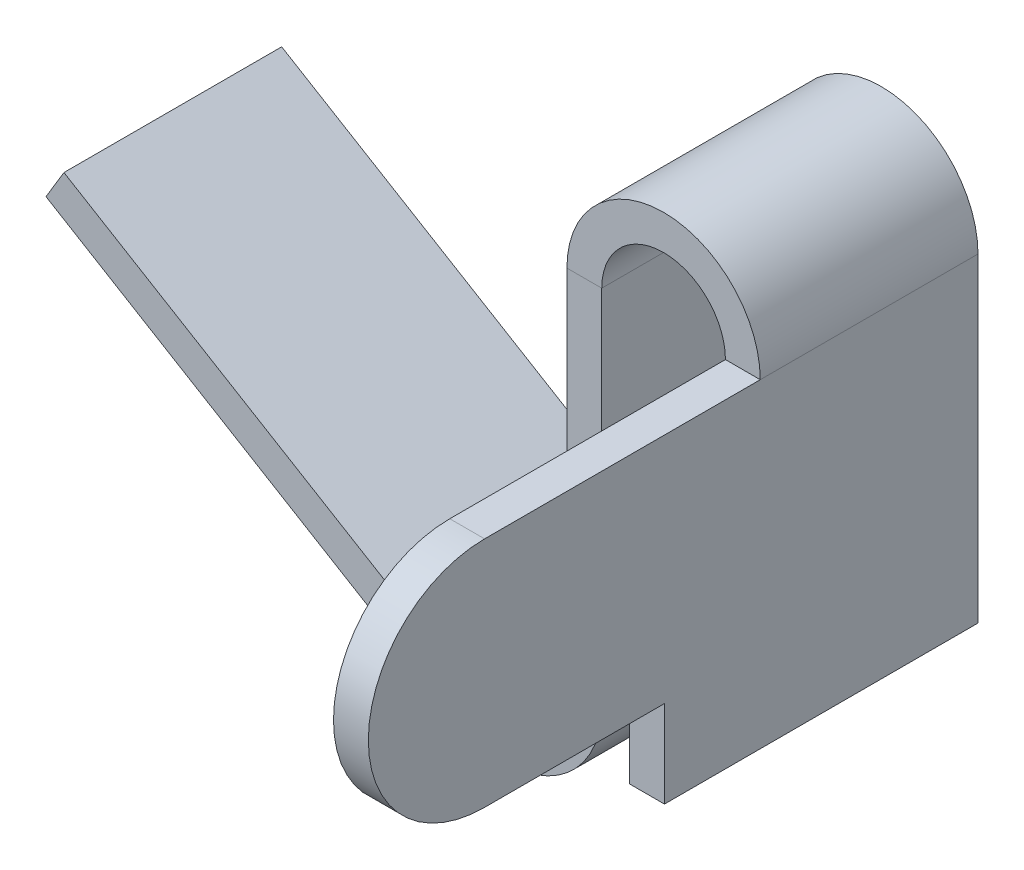
ISO-10303-21;
HEADER;
FILE_DESCRIPTION(('STEP AP214'),'2;1');
FILE_NAME('part.step','',(''),(''),'','','');
FILE_SCHEMA(('AUTOMOTIVE_DESIGN { 1 0 10303 214 1 1 1 1 }'));
ENDSEC;
DATA;
#1=APPLICATION_CONTEXT('core data for automotive mechanical design processes');
#2=APPLICATION_PROTOCOL_DEFINITION('international standard','automotive_design',2000,#1);
#3=PRODUCT_CONTEXT('',#1,'mechanical');
#4=PRODUCT('Part','Part','',(#3));
#5=PRODUCT_RELATED_PRODUCT_CATEGORY('part','',(#4));
#6=PRODUCT_DEFINITION_FORMATION('','',#4);
#7=PRODUCT_DEFINITION_CONTEXT('part definition',#1,'design');
#8=PRODUCT_DEFINITION('design','',#6,#7);
#9=PRODUCT_DEFINITION_SHAPE('','',#8);
#10=(LENGTH_UNIT() NAMED_UNIT(*) SI_UNIT(.MILLI.,.METRE.));
#11=(NAMED_UNIT(*) PLANE_ANGLE_UNIT() SI_UNIT($,.RADIAN.));
#12=(NAMED_UNIT(*) SI_UNIT($,.STERADIAN.) SOLID_ANGLE_UNIT());
#13=UNCERTAINTY_MEASURE_WITH_UNIT(LENGTH_MEASURE(1.E-05),#10,'distance_accuracy_value','');
#14=(GEOMETRIC_REPRESENTATION_CONTEXT(3) GLOBAL_UNCERTAINTY_ASSIGNED_CONTEXT((#13)) GLOBAL_UNIT_ASSIGNED_CONTEXT((#10,
#11,#12)) REPRESENTATION_CONTEXT('',''));
#15=CARTESIAN_POINT('',(0.,0.,0.));
#16=DIRECTION('',(0.,0.,1.));
#17=DIRECTION('',(1.,0.,0.));
#18=AXIS2_PLACEMENT_3D('',#15,#16,#17);
#19=CARTESIAN_POINT('',(1.11,0.5,5.665));
#20=DIRECTION('',(-1.,0.,0.));
#21=DIRECTION('',(0.,-1.,0.));
#22=AXIS2_PLACEMENT_3D('',#19,#20,#21);
#23=CYLINDRICAL_SURFACE('',#22,1.335);
#24=DIRECTION('',(1.,0.,0.));
#25=VECTOR('',#24,1.);
#26=CARTESIAN_POINT('',(1.11,-0.835,5.665));
#27=LINE('',#26,#25);
#28=CARTESIAN_POINT('',(1.11,-0.835,5.665));
#29=VERTEX_POINT('',#28);
#30=CARTESIAN_POINT('',(0.709999999999999,-0.835,5.665));
#31=VERTEX_POINT('',#30);
#32=EDGE_CURVE('E217',#29,#31,#27,.F.);
#33=ORIENTED_EDGE('',*,*,#32,.F.);
#34=CARTESIAN_POINT('',(1.11,0.5,5.665));
#35=DIRECTION('',(-1.,0.,0.));
#36=DIRECTION('',(0.,-1.,0.));
#37=AXIS2_PLACEMENT_3D('',#34,#35,#36);
#38=CIRCLE('',#37,1.335);
#39=CARTESIAN_POINT('',(1.11,1.835,5.665));
#40=VERTEX_POINT('',#39);
#41=EDGE_CURVE('E53',#40,#29,#38,.F.);
#42=ORIENTED_EDGE('',*,*,#41,.F.);
#43=DIRECTION('',(1.,0.,0.));
#44=VECTOR('',#43,1.);
#45=CARTESIAN_POINT('',(1.11,1.835,5.665));
#46=LINE('',#45,#44);
#47=CARTESIAN_POINT('',(0.709999999999999,1.835,5.665));
#48=VERTEX_POINT('',#47);
#49=EDGE_CURVE('E220',#48,#40,#46,.T.);
#50=ORIENTED_EDGE('',*,*,#49,.F.);
#51=CARTESIAN_POINT('',(0.709999999999999,0.5,5.665));
#52=DIRECTION('',(-1.,0.,0.));
#53=DIRECTION('',(0.,-1.,0.));
#54=AXIS2_PLACEMENT_3D('',#51,#52,#53);
#55=CIRCLE('',#54,1.335);
#56=EDGE_CURVE('E11',#31,#48,#55,.T.);
#57=ORIENTED_EDGE('',*,*,#56,.F.);
#58=EDGE_LOOP('',(#33,#42,#50,#57));
#59=FACE_BOUND('',#58,.T.);
#60=ADVANCED_FACE('F45',(#59),#23,.T.);
#61=CARTESIAN_POINT('',(-0.71,1.835,2.5));
#62=DIRECTION('',(0.,0.,1.));
#63=DIRECTION('',(1.,0.,0.));
#64=AXIS2_PLACEMENT_3D('',#61,#62,#63);
#65=PLANE('',#64);
#66=DIRECTION('',(-1.,0.,0.));
#67=VECTOR('',#66,1.);
#68=CARTESIAN_POINT('',(-0.71,1.835,2.5));
#69=LINE('',#68,#67);
#70=CARTESIAN_POINT('',(-0.71,1.835,2.5));
#71=VERTEX_POINT('',#70);
#72=CARTESIAN_POINT('',(-1.11,1.835,2.5));
#73=VERTEX_POINT('',#72);
#74=EDGE_CURVE('E215',#71,#73,#69,.T.);
#75=ORIENTED_EDGE('',*,*,#74,.F.);
#76=CARTESIAN_POINT('',(0.,1.835,2.5));
#77=DIRECTION('',(0.,0.,1.));
#78=DIRECTION('',(1.,0.,0.));
#79=AXIS2_PLACEMENT_3D('',#76,#77,#78);
#80=CIRCLE('',#79,0.709999999999999);
#81=CARTESIAN_POINT('',(0.709999999999999,1.835,2.5));
#82=VERTEX_POINT('',#81);
#83=EDGE_CURVE('E250',#82,#71,#80,.T.);
#84=ORIENTED_EDGE('',*,*,#83,.F.);
#85=DIRECTION('',(-1.,0.,0.));
#86=VECTOR('',#85,1.);
#87=CARTESIAN_POINT('',(1.11,1.835,2.5));
#88=LINE('',#87,#86);
#89=CARTESIAN_POINT('',(1.11,1.835,2.5));
#90=VERTEX_POINT('',#89);
#91=EDGE_CURVE('E212',#90,#82,#88,.T.);
#92=ORIENTED_EDGE('',*,*,#91,.F.);
#93=CARTESIAN_POINT('',(0.,1.835,2.5));
#94=DIRECTION('',(0.,0.,1.));
#95=DIRECTION('',(1.,0.,0.));
#96=AXIS2_PLACEMENT_3D('',#93,#94,#95);
#97=CIRCLE('',#96,1.11);
#98=EDGE_CURVE('E253',#90,#73,#97,.T.);
#99=ORIENTED_EDGE('',*,*,#98,.T.);
#100=EDGE_LOOP('',(#75,#84,#92,#99));
#101=FACE_BOUND('',#100,.T.);
#102=ADVANCED_FACE('F349',(#101),#65,.T.);
#103=CARTESIAN_POINT('',(1.11,1.835,2.5));
#104=DIRECTION('',(0.,0.,1.));
#105=DIRECTION('',(1.,0.,0.));
#106=AXIS2_PLACEMENT_3D('',#103,#104,#105);
#107=PLANE('',#106);
#108=DIRECTION('',(0.,-1.,0.));
#109=VECTOR('',#108,1.);
#110=CARTESIAN_POINT('',(-0.71,1.835,2.5));
#111=LINE('',#110,#109);
#112=CARTESIAN_POINT('',(-0.709999999999999,-2.335,2.5));
#113=VERTEX_POINT('',#112);
#114=EDGE_CURVE('E247',#71,#113,#111,.T.);
#115=ORIENTED_EDGE('',*,*,#114,.F.);
#116=ORIENTED_EDGE('',*,*,#74,.T.);
#117=DIRECTION('',(0.,-1.,0.));
#118=VECTOR('',#117,1.);
#119=CARTESIAN_POINT('',(-1.11,1.835,2.5));
#120=LINE('',#119,#118);
#121=CARTESIAN_POINT('',(-1.11,-2.335,2.5));
#122=VERTEX_POINT('',#121);
#123=EDGE_CURVE('E256',#73,#122,#120,.T.);
#124=ORIENTED_EDGE('',*,*,#123,.T.);
#125=DIRECTION('',(1.,0.,0.));
#126=VECTOR('',#125,1.);
#127=CARTESIAN_POINT('',(-1.11,-2.335,2.5));
#128=LINE('',#127,#126);
#129=EDGE_CURVE('E204',#122,#113,#128,.T.);
#130=ORIENTED_EDGE('',*,*,#129,.T.);
#131=EDGE_LOOP('',(#115,#116,#124,#130));
#132=FACE_BOUND('',#131,.T.);
#133=ADVANCED_FACE('F345',(#132),#107,.T.);
#134=CARTESIAN_POINT('',(0.709999999999999,1.835,0.));
#135=DIRECTION('',(0.,0.,-1.));
#136=DIRECTION('',(-1.,0.,0.));
#137=AXIS2_PLACEMENT_3D('',#134,#135,#136);
#138=PLANE('',#137);
#139=DIRECTION('',(1.,0.,0.));
#140=VECTOR('',#139,1.);
#141=CARTESIAN_POINT('',(0.709999999999999,1.835,0.));
#142=LINE('',#141,#140);
#143=CARTESIAN_POINT('',(0.709999999999999,1.835,0.));
#144=VERTEX_POINT('',#143);
#145=CARTESIAN_POINT('',(1.11,1.835,0.));
#146=VERTEX_POINT('',#145);
#147=EDGE_CURVE('E210',#144,#146,#142,.T.);
#148=ORIENTED_EDGE('',*,*,#147,.F.);
#149=CARTESIAN_POINT('',(0.,1.835,0.));
#150=DIRECTION('',(0.,0.,1.));
#151=DIRECTION('',(1.,0.,0.));
#152=AXIS2_PLACEMENT_3D('',#149,#150,#151);
#153=CIRCLE('',#152,0.709999999999999);
#154=CARTESIAN_POINT('',(-0.71,1.835,0.));
#155=VERTEX_POINT('',#154);
#156=EDGE_CURVE('E277',#144,#155,#153,.T.);
#157=ORIENTED_EDGE('',*,*,#156,.T.);
#158=DIRECTION('',(1.,0.,0.));
#159=VECTOR('',#158,1.);
#160=CARTESIAN_POINT('',(-1.11,1.835,0.));
#161=LINE('',#160,#159);
#162=CARTESIAN_POINT('',(-1.11,1.835,0.));
#163=VERTEX_POINT('',#162);
#164=EDGE_CURVE('E208',#163,#155,#161,.T.);
#165=ORIENTED_EDGE('',*,*,#164,.F.);
#166=CARTESIAN_POINT('',(0.,1.835,0.));
#167=DIRECTION('',(0.,0.,1.));
#168=DIRECTION('',(1.,0.,0.));
#169=AXIS2_PLACEMENT_3D('',#166,#167,#168);
#170=CIRCLE('',#169,1.11);
#171=EDGE_CURVE('E286',#146,#163,#170,.T.);
#172=ORIENTED_EDGE('',*,*,#171,.F.);
#173=EDGE_LOOP('',(#148,#157,#165,#172));
#174=FACE_BOUND('',#173,.T.);
#175=ADVANCED_FACE('F353',(#174),#138,.T.);
#176=CARTESIAN_POINT('',(-1.11,1.835,0.));
#177=DIRECTION('',(0.,0.,-1.));
#178=DIRECTION('',(-1.,0.,0.));
#179=AXIS2_PLACEMENT_3D('',#176,#177,#178);
#180=PLANE('',#179);
#181=DIRECTION('',(0.,1.,0.));
#182=VECTOR('',#181,1.);
#183=CARTESIAN_POINT('',(0.71,-1.835,0.));
#184=LINE('',#183,#182);
#185=CARTESIAN_POINT('',(0.71,-1.835,0.));
#186=VERTEX_POINT('',#185);
#187=EDGE_CURVE('E280',#186,#144,#184,.T.);
#188=ORIENTED_EDGE('',*,*,#187,.T.);
#189=ORIENTED_EDGE('',*,*,#147,.T.);
#190=DIRECTION('',(0.,1.,0.));
#191=VECTOR('',#190,1.);
#192=CARTESIAN_POINT('',(1.11,-1.835,0.));
#193=LINE('',#192,#191);
#194=CARTESIAN_POINT('',(1.11,-1.835,0.));
#195=VERTEX_POINT('',#194);
#196=EDGE_CURVE('E284',#195,#146,#193,.T.);
#197=ORIENTED_EDGE('',*,*,#196,.F.);
#198=DIRECTION('',(-1.,0.,0.));
#199=VECTOR('',#198,1.);
#200=CARTESIAN_POINT('',(1.11,-1.835,0.));
#201=LINE('',#200,#199);
#202=EDGE_CURVE('E174',#195,#186,#201,.T.);
#203=ORIENTED_EDGE('',*,*,#202,.T.);
#204=EDGE_LOOP('',(#188,#189,#197,#203));
#205=FACE_BOUND('',#204,.T.);
#206=ADVANCED_FACE('F360',(#205),#180,.T.);
#207=CARTESIAN_POINT('',(-2.37654188240106,-3.27788403077232,2.5));
#208=DIRECTION('',(0.,0.,1.));
#209=DIRECTION('',(1.,0.,0.));
#210=AXIS2_PLACEMENT_3D('',#207,#208,#209);
#211=PLANE('',#210);
#212=DIRECTION('',(0.515038074910058,0.85716730070211,0.));
#213=VECTOR('',#212,1.);
#214=CARTESIAN_POINT('',(-2.37654188240106,-3.27788403077232,2.5));
#215=LINE('',#214,#213);
#216=CARTESIAN_POINT('',(-2.37654188240106,-3.27788403077232,2.5));
#217=VERTEX_POINT('',#216);
#218=CARTESIAN_POINT('',(-2.17052665243704,-2.93501711049148,2.5));
#219=VERTEX_POINT('',#218);
#220=EDGE_CURVE('E206',#217,#219,#215,.T.);
#221=ORIENTED_EDGE('',*,*,#220,.F.);
#222=CARTESIAN_POINT('',(-1.81,-2.335,2.5));
#223=DIRECTION('',(0.,0.,-1.));
#224=DIRECTION('',(-1.,0.,0.));
#225=AXIS2_PLACEMENT_3D('',#222,#223,#224);
#226=CIRCLE('',#225,1.1);
#227=EDGE_CURVE('E244',#113,#217,#226,.T.);
#228=ORIENTED_EDGE('',*,*,#227,.F.);
#229=ORIENTED_EDGE('',*,*,#129,.F.);
#230=CARTESIAN_POINT('',(-1.81,-2.335,2.5));
#231=DIRECTION('',(0.,0.,1.));
#232=DIRECTION('',(1.,0.,0.));
#233=AXIS2_PLACEMENT_3D('',#230,#231,#232);
#234=CIRCLE('',#233,0.7);
#235=EDGE_CURVE('E259',#122,#219,#234,.F.);
#236=ORIENTED_EDGE('',*,*,#235,.T.);
#237=EDGE_LOOP('',(#221,#228,#229,#236));
#238=FACE_BOUND('',#237,.T.);
#239=ADVANCED_FACE('F343',(#238),#211,.T.);
#240=CARTESIAN_POINT('',(-1.11,-2.335,2.5));
#241=DIRECTION('',(0.,0.,1.));
#242=DIRECTION('',(1.,0.,0.));
#243=AXIS2_PLACEMENT_3D('',#240,#241,#242);
#244=PLANE('',#243);
#245=DIRECTION('',(-0.85716730070211,0.515038074910058,0.));
#246=VECTOR('',#245,1.);
#247=CARTESIAN_POINT('',(-2.37654188240106,-3.27788403077232,2.5));
#248=LINE('',#247,#246);
#249=CARTESIAN_POINT('',(-7.09096203626267,-0.445174618767003,2.5));
#250=VERTEX_POINT('',#249);
#251=EDGE_CURVE('E241',#217,#250,#248,.T.);
#252=ORIENTED_EDGE('',*,*,#251,.F.);
#253=ORIENTED_EDGE('',*,*,#220,.T.);
#254=DIRECTION('',(-0.85716730070211,0.515038074910058,0.));
#255=VECTOR('',#254,1.);
#256=CARTESIAN_POINT('',(-2.17052665243704,-2.93501711049148,2.5));
#257=LINE('',#256,#255);
#258=CARTESIAN_POINT('',(-6.88494680629864,-0.102307698486159,2.5));
#259=VERTEX_POINT('',#258);
#260=EDGE_CURVE('E235',#219,#259,#257,.T.);
#261=ORIENTED_EDGE('',*,*,#260,.T.);
#262=DIRECTION('',(0.515038074910058,0.85716730070211,0.));
#263=VECTOR('',#262,1.);
#264=CARTESIAN_POINT('',(-7.09096203626267,-0.445174618767003,2.5));
#265=LINE('',#264,#263);
#266=EDGE_CURVE('E237',#250,#259,#265,.T.);
#267=ORIENTED_EDGE('',*,*,#266,.F.);
#268=EDGE_LOOP('',(#252,#253,#261,#267));
#269=FACE_BOUND('',#268,.T.);
#270=ADVANCED_FACE('F341',(#269),#244,.T.);
#271=CARTESIAN_POINT('',(-0.709999999999999,-2.335,0.));
#272=DIRECTION('',(0.,0.,-1.));
#273=DIRECTION('',(-1.,0.,0.));
#274=AXIS2_PLACEMENT_3D('',#271,#272,#273);
#275=PLANE('',#274);
#276=DIRECTION('',(-1.,0.,0.));
#277=VECTOR('',#276,1.);
#278=CARTESIAN_POINT('',(-0.709999999999999,-2.335,0.));
#279=LINE('',#278,#277);
#280=CARTESIAN_POINT('',(-0.709999999999999,-2.335,0.));
#281=VERTEX_POINT('',#280);
#282=CARTESIAN_POINT('',(-1.11,-2.335,0.));
#283=VERTEX_POINT('',#282);
#284=EDGE_CURVE('E202',#281,#283,#279,.T.);
#285=ORIENTED_EDGE('',*,*,#284,.F.);
#286=CARTESIAN_POINT('',(-1.81,-2.335,0.));
#287=DIRECTION('',(0.,0.,-1.));
#288=DIRECTION('',(-1.,0.,0.));
#289=AXIS2_PLACEMENT_3D('',#286,#287,#288);
#290=CIRCLE('',#289,1.1);
#291=CARTESIAN_POINT('',(-2.37654188240106,-3.27788403077232,0.));
#292=VERTEX_POINT('',#291);
#293=EDGE_CURVE('E271',#281,#292,#290,.T.);
#294=ORIENTED_EDGE('',*,*,#293,.T.);
#295=DIRECTION('',(-0.515038074910058,-0.85716730070211,0.));
#296=VECTOR('',#295,1.);
#297=CARTESIAN_POINT('',(-2.17052665243704,-2.93501711049148,0.));
#298=LINE('',#297,#296);
#299=CARTESIAN_POINT('',(-2.17052665243704,-2.93501711049148,0.));
#300=VERTEX_POINT('',#299);
#301=EDGE_CURVE('E200',#300,#292,#298,.T.);
#302=ORIENTED_EDGE('',*,*,#301,.F.);
#303=CARTESIAN_POINT('',(-1.81,-2.335,0.));
#304=DIRECTION('',(0.,0.,1.));
#305=DIRECTION('',(1.,0.,0.));
#306=AXIS2_PLACEMENT_3D('',#303,#304,#305);
#307=CIRCLE('',#306,0.7);
#308=EDGE_CURVE('E238',#283,#300,#307,.F.);
#309=ORIENTED_EDGE('',*,*,#308,.F.);
#310=EDGE_LOOP('',(#285,#294,#302,#309));
#311=FACE_BOUND('',#310,.T.);
#312=ADVANCED_FACE('F312',(#311),#275,.T.);
#313=CARTESIAN_POINT('',(-2.17052665243704,-2.93501711049148,0.));
#314=DIRECTION('',(0.,0.,-1.));
#315=DIRECTION('',(-1.,0.,0.));
#316=AXIS2_PLACEMENT_3D('',#313,#314,#315);
#317=PLANE('',#316);
#318=DIRECTION('',(0.,-1.,0.));
#319=VECTOR('',#318,1.);
#320=CARTESIAN_POINT('',(-0.71,1.835,0.));
#321=LINE('',#320,#319);
#322=EDGE_CURVE('E274',#155,#281,#321,.T.);
#323=ORIENTED_EDGE('',*,*,#322,.T.);
#324=ORIENTED_EDGE('',*,*,#284,.T.);
#325=DIRECTION('',(0.,-1.,0.));
#326=VECTOR('',#325,1.);
#327=CARTESIAN_POINT('',(-1.11,1.835,0.));
#328=LINE('',#327,#326);
#329=EDGE_CURVE('E289',#163,#283,#328,.T.);
#330=ORIENTED_EDGE('',*,*,#329,.F.);
#331=ORIENTED_EDGE('',*,*,#164,.T.);
#332=EDGE_LOOP('',(#323,#324,#330,#331));
#333=FACE_BOUND('',#332,.T.);
#334=ADVANCED_FACE('F308',(#333),#317,.T.);
#335=CARTESIAN_POINT('',(-2.17052665243704,-2.93501711049148,2.5));
#336=DIRECTION('',(-0.515038074910058,-0.85716730070211,0.));
#337=DIRECTION('',(0.85716730070211,-0.515038074910058,0.));
#338=AXIS2_PLACEMENT_3D('',#335,#336,#337);
#339=PLANE('',#338);
#340=DIRECTION('',(-0.85716730070211,0.515038074910058,0.));
#341=VECTOR('',#340,1.);
#342=CARTESIAN_POINT('',(-2.17052665243704,-2.93501711049148,0.));
#343=LINE('',#342,#341);
#344=CARTESIAN_POINT('',(-6.88494680629864,-0.102307698486159,0.));
#345=VERTEX_POINT('',#344);
#346=EDGE_CURVE('E234',#300,#345,#343,.T.);
#347=ORIENTED_EDGE('',*,*,#346,.T.);
#348=DIRECTION('',(0.,0.,-1.));
#349=VECTOR('',#348,1.);
#350=CARTESIAN_POINT('',(-6.88494680629864,-0.102307698486159,2.5));
#351=LINE('',#350,#349);
#352=EDGE_CURVE('E198',#259,#345,#351,.T.);
#353=ORIENTED_EDGE('',*,*,#352,.F.);
#354=ORIENTED_EDGE('',*,*,#260,.F.);
#355=DIRECTION('',(0.,0.,-1.));
#356=VECTOR('',#355,1.);
#357=CARTESIAN_POINT('',(-2.17052665243704,-2.93501711049148,2.5));
#358=LINE('',#357,#356);
#359=EDGE_CURVE('E262',#219,#300,#358,.T.);
#360=ORIENTED_EDGE('',*,*,#359,.T.);
#361=EDGE_LOOP('',(#347,#353,#354,#360));
#362=FACE_BOUND('',#361,.T.);
#363=ADVANCED_FACE('F337',(#362),#339,.F.);
#364=CARTESIAN_POINT('',(-7.09096203626267,-0.445174618767003,2.5));
#365=DIRECTION('',(-0.85716730070211,0.515038074910058,0.));
#366=DIRECTION('',(-0.515038074910058,-0.85716730070211,0.));
#367=AXIS2_PLACEMENT_3D('',#364,#365,#366);
#368=PLANE('',#367);
#369=DIRECTION('',(0.515038074910058,0.85716730070211,0.));
#370=VECTOR('',#369,1.);
#371=CARTESIAN_POINT('',(-7.09096203626267,-0.445174618767003,0.));
#372=LINE('',#371,#370);
#373=CARTESIAN_POINT('',(-7.09096203626267,-0.445174618767003,0.));
#374=VERTEX_POINT('',#373);
#375=EDGE_CURVE('E265',#374,#345,#372,.T.);
#376=ORIENTED_EDGE('',*,*,#375,.F.);
#377=DIRECTION('',(0.,0.,-1.));
#378=VECTOR('',#377,1.);
#379=CARTESIAN_POINT('',(-7.09096203626267,-0.445174618767003,2.5));
#380=LINE('',#379,#378);
#381=EDGE_CURVE('E196',#250,#374,#380,.T.);
#382=ORIENTED_EDGE('',*,*,#381,.F.);
#383=ORIENTED_EDGE('',*,*,#266,.T.);
#384=ORIENTED_EDGE('',*,*,#352,.T.);
#385=EDGE_LOOP('',(#376,#382,#383,#384));
#386=FACE_BOUND('',#385,.T.);
#387=ADVANCED_FACE('F399',(#386),#368,.T.);
#388=CARTESIAN_POINT('',(-2.37654188240106,-3.27788403077232,2.5));
#389=DIRECTION('',(-0.515038074910058,-0.85716730070211,0.));
#390=DIRECTION('',(0.85716730070211,-0.515038074910058,0.));
#391=AXIS2_PLACEMENT_3D('',#388,#389,#390);
#392=PLANE('',#391);
#393=DIRECTION('',(-0.85716730070211,0.515038074910058,0.));
#394=VECTOR('',#393,1.);
#395=CARTESIAN_POINT('',(-2.37654188240106,-3.27788403077232,0.));
#396=LINE('',#395,#394);
#397=EDGE_CURVE('E268',#292,#374,#396,.T.);
#398=ORIENTED_EDGE('',*,*,#397,.F.);
#399=DIRECTION('',(0.,0.,-1.));
#400=VECTOR('',#399,1.);
#401=CARTESIAN_POINT('',(-2.37654188240106,-3.27788403077232,2.5));
#402=LINE('',#401,#400);
#403=EDGE_CURVE('E193',#217,#292,#402,.T.);
#404=ORIENTED_EDGE('',*,*,#403,.F.);
#405=ORIENTED_EDGE('',*,*,#251,.T.);
#406=ORIENTED_EDGE('',*,*,#381,.T.);
#407=EDGE_LOOP('',(#398,#404,#405,#406));
#408=FACE_BOUND('',#407,.T.);
#409=ADVANCED_FACE('F326',(#408),#392,.T.);
#410=CARTESIAN_POINT('',(-1.81,-2.335,2.5));
#411=DIRECTION('',(0.,0.,-1.));
#412=DIRECTION('',(-1.,0.,0.));
#413=AXIS2_PLACEMENT_3D('',#410,#411,#412);
#414=CYLINDRICAL_SURFACE('',#413,1.1);
#415=ORIENTED_EDGE('',*,*,#293,.F.);
#416=DIRECTION('',(0.,0.,-1.));
#417=VECTOR('',#416,1.);
#418=CARTESIAN_POINT('',(-0.709999999999999,-2.335,2.5));
#419=LINE('',#418,#417);
#420=EDGE_CURVE('E190',#113,#281,#419,.T.);
#421=ORIENTED_EDGE('',*,*,#420,.F.);
#422=ORIENTED_EDGE('',*,*,#227,.T.);
#423=ORIENTED_EDGE('',*,*,#403,.T.);
#424=EDGE_LOOP('',(#415,#421,#422,#423));
#425=FACE_BOUND('',#424,.T.);
#426=ADVANCED_FACE('F321',(#425),#414,.T.);
#427=CARTESIAN_POINT('',(-0.71,1.835,2.5));
#428=DIRECTION('',(1.,0.,0.));
#429=DIRECTION('',(0.,1.,0.));
#430=AXIS2_PLACEMENT_3D('',#427,#428,#429);
#431=PLANE('',#430);
#432=ORIENTED_EDGE('',*,*,#322,.F.);
#433=DIRECTION('',(0.,0.,-1.));
#434=VECTOR('',#433,1.);
#435=CARTESIAN_POINT('',(-0.71,1.835,2.5));
#436=LINE('',#435,#434);
#437=EDGE_CURVE('E187',#71,#155,#436,.T.);
#438=ORIENTED_EDGE('',*,*,#437,.F.);
#439=ORIENTED_EDGE('',*,*,#114,.T.);
#440=ORIENTED_EDGE('',*,*,#420,.T.);
#441=EDGE_LOOP('',(#432,#438,#439,#440));
#442=FACE_BOUND('',#441,.T.);
#443=ADVANCED_FACE('F316',(#442),#431,.T.);
#444=CARTESIAN_POINT('',(0.,1.835,2.5));
#445=DIRECTION('',(0.,0.,-1.));
#446=DIRECTION('',(-1.,0.,0.));
#447=AXIS2_PLACEMENT_3D('',#444,#445,#446);
#448=CYLINDRICAL_SURFACE('',#447,0.709999999999999);
#449=ORIENTED_EDGE('',*,*,#156,.F.);
#450=DIRECTION('',(0.,0.,-1.));
#451=VECTOR('',#450,1.);
#452=CARTESIAN_POINT('',(0.709999999999999,1.835,2.5));
#453=LINE('',#452,#451);
#454=EDGE_CURVE('E178',#82,#144,#453,.T.);
#455=ORIENTED_EDGE('',*,*,#454,.F.);
#456=ORIENTED_EDGE('',*,*,#83,.T.);
#457=ORIENTED_EDGE('',*,*,#437,.T.);
#458=EDGE_LOOP('',(#449,#455,#456,#457));
#459=FACE_BOUND('',#458,.T.);
#460=ADVANCED_FACE('F357',(#459),#448,.F.);
#461=CARTESIAN_POINT('',(0.71,-1.835,2.5));
#462=DIRECTION('',(-1.,0.,0.));
#463=DIRECTION('',(0.,-1.,0.));
#464=AXIS2_PLACEMENT_3D('',#461,#462,#463);
#465=PLANE('',#464);
#466=DIRECTION('',(0.,0.,-1.));
#467=VECTOR('',#466,1.);
#468=CARTESIAN_POINT('',(0.709999999999999,-0.835,2.5));
#469=LINE('',#468,#467);
#470=CARTESIAN_POINT('',(0.709999999999999,-0.835,3.6));
#471=VERTEX_POINT('',#470);
#472=EDGE_CURVE('E227',#31,#471,#469,.T.);
#473=ORIENTED_EDGE('',*,*,#472,.F.);
#474=ORIENTED_EDGE('',*,*,#56,.T.);
#475=DIRECTION('',(0.,0.,-1.));
#476=VECTOR('',#475,1.);
#477=CARTESIAN_POINT('',(0.709999999999999,1.835,7.));
#478=LINE('',#477,#476);
#479=EDGE_CURVE('E231',#48,#82,#478,.T.);
#480=ORIENTED_EDGE('',*,*,#479,.T.);
#481=ORIENTED_EDGE('',*,*,#454,.T.);
#482=ORIENTED_EDGE('',*,*,#187,.F.);
#483=DIRECTION('',(0.,0.,-1.));
#484=VECTOR('',#483,1.);
#485=CARTESIAN_POINT('',(0.71,-1.835,2.5));
#486=LINE('',#485,#484);
#487=CARTESIAN_POINT('',(0.71,-1.835,3.6));
#488=VERTEX_POINT('',#487);
#489=EDGE_CURVE('E175',#488,#186,#486,.T.);
#490=ORIENTED_EDGE('',*,*,#489,.F.);
#491=DIRECTION('',(0.,-1.,0.));
#492=VECTOR('',#491,1.);
#493=CARTESIAN_POINT('',(0.71,-1.835,3.6));
#494=LINE('',#493,#492);
#495=EDGE_CURVE('E156',#471,#488,#494,.T.);
#496=ORIENTED_EDGE('',*,*,#495,.F.);
#497=EDGE_LOOP('',(#473,#474,#480,#481,#482,#490,#496));
#498=FACE_BOUND('',#497,.T.);
#499=ADVANCED_FACE('F361',(#498),#465,.T.);
#500=CARTESIAN_POINT('',(1.11,-1.835,2.5));
#501=DIRECTION('',(0.,-1.,0.));
#502=DIRECTION('',(1.,0.,0.));
#503=AXIS2_PLACEMENT_3D('',#500,#501,#502);
#504=PLANE('',#503);
#505=DIRECTION('',(1.,0.,0.));
#506=VECTOR('',#505,1.);
#507=CARTESIAN_POINT('',(-3.39,-1.835,3.6));
#508=LINE('',#507,#506);
#509=CARTESIAN_POINT('',(1.11,-1.835,3.6));
#510=VERTEX_POINT('',#509);
#511=EDGE_CURVE('E149',#488,#510,#508,.T.);
#512=ORIENTED_EDGE('',*,*,#511,.F.);
#513=ORIENTED_EDGE('',*,*,#489,.T.);
#514=ORIENTED_EDGE('',*,*,#202,.F.);
#515=DIRECTION('',(0.,0.,-1.));
#516=VECTOR('',#515,1.);
#517=CARTESIAN_POINT('',(1.11,-1.835,2.5));
#518=LINE('',#517,#516);
#519=EDGE_CURVE('E167',#510,#195,#518,.T.);
#520=ORIENTED_EDGE('',*,*,#519,.F.);
#521=EDGE_LOOP('',(#512,#513,#514,#520));
#522=FACE_BOUND('',#521,.T.);
#523=ADVANCED_FACE('F172',(#522),#504,.T.);
#524=CARTESIAN_POINT('',(1.11,-1.835,2.5));
#525=DIRECTION('',(-1.,0.,0.));
#526=DIRECTION('',(0.,-1.,0.));
#527=AXIS2_PLACEMENT_3D('',#524,#525,#526);
#528=PLANE('',#527);
#529=DIRECTION('',(0.,0.,-1.));
#530=VECTOR('',#529,1.);
#531=CARTESIAN_POINT('',(1.11,1.835,7.));
#532=LINE('',#531,#530);
#533=EDGE_CURVE('E222',#40,#90,#532,.T.);
#534=ORIENTED_EDGE('',*,*,#533,.F.);
#535=ORIENTED_EDGE('',*,*,#41,.T.);
#536=DIRECTION('',(0.,0.,1.));
#537=VECTOR('',#536,1.);
#538=CARTESIAN_POINT('',(1.11,-0.835,7.));
#539=LINE('',#538,#537);
#540=CARTESIAN_POINT('',(1.11,-0.835,3.6));
#541=VERTEX_POINT('',#540);
#542=EDGE_CURVE('E161',#541,#29,#539,.T.);
#543=ORIENTED_EDGE('',*,*,#542,.F.);
#544=DIRECTION('',(0.,1.,0.));
#545=VECTOR('',#544,1.);
#546=CARTESIAN_POINT('',(1.11,-1.835,3.6));
#547=LINE('',#546,#545);
#548=EDGE_CURVE('E153',#510,#541,#547,.T.);
#549=ORIENTED_EDGE('',*,*,#548,.F.);
#550=ORIENTED_EDGE('',*,*,#519,.T.);
#551=ORIENTED_EDGE('',*,*,#196,.T.);
#552=DIRECTION('',(0.,0.,-1.));
#553=VECTOR('',#552,1.);
#554=CARTESIAN_POINT('',(1.11,1.835,2.5));
#555=LINE('',#554,#553);
#556=EDGE_CURVE('E176',#90,#146,#555,.T.);
#557=ORIENTED_EDGE('',*,*,#556,.F.);
#558=EDGE_LOOP('',(#534,#535,#543,#549,#550,#551,#557));
#559=FACE_BOUND('',#558,.T.);
#560=ADVANCED_FACE('F165',(#559),#528,.F.);
#561=CARTESIAN_POINT('',(0.,1.835,2.5));
#562=DIRECTION('',(0.,0.,-1.));
#563=DIRECTION('',(-1.,0.,0.));
#564=AXIS2_PLACEMENT_3D('',#561,#562,#563);
#565=CYLINDRICAL_SURFACE('',#564,1.11);
#566=ORIENTED_EDGE('',*,*,#171,.T.);
#567=DIRECTION('',(0.,0.,-1.));
#568=VECTOR('',#567,1.);
#569=CARTESIAN_POINT('',(-1.11,1.835,2.5));
#570=LINE('',#569,#568);
#571=EDGE_CURVE('E181',#73,#163,#570,.T.);
#572=ORIENTED_EDGE('',*,*,#571,.F.);
#573=ORIENTED_EDGE('',*,*,#98,.F.);
#574=ORIENTED_EDGE('',*,*,#556,.T.);
#575=EDGE_LOOP('',(#566,#572,#573,#574));
#576=FACE_BOUND('',#575,.T.);
#577=ADVANCED_FACE('F350',(#576),#565,.T.);
#578=CARTESIAN_POINT('',(-1.11,1.835,2.5));
#579=DIRECTION('',(1.,0.,0.));
#580=DIRECTION('',(0.,1.,0.));
#581=AXIS2_PLACEMENT_3D('',#578,#579,#580);
#582=PLANE('',#581);
#583=ORIENTED_EDGE('',*,*,#329,.T.);
#584=DIRECTION('',(0.,0.,-1.));
#585=VECTOR('',#584,1.);
#586=CARTESIAN_POINT('',(-1.11,-2.335,2.5));
#587=LINE('',#586,#585);
#588=EDGE_CURVE('E296',#122,#283,#587,.T.);
#589=ORIENTED_EDGE('',*,*,#588,.F.);
#590=ORIENTED_EDGE('',*,*,#123,.F.);
#591=ORIENTED_EDGE('',*,*,#571,.T.);
#592=EDGE_LOOP('',(#583,#589,#590,#591));
#593=FACE_BOUND('',#592,.T.);
#594=ADVANCED_FACE('F303',(#593),#582,.F.);
#595=CARTESIAN_POINT('',(-1.81,-2.335,2.5));
#596=DIRECTION('',(0.,0.,-1.));
#597=DIRECTION('',(-1.,0.,0.));
#598=AXIS2_PLACEMENT_3D('',#595,#596,#597);
#599=CYLINDRICAL_SURFACE('',#598,0.7);
#600=ORIENTED_EDGE('',*,*,#308,.T.);
#601=ORIENTED_EDGE('',*,*,#359,.F.);
#602=ORIENTED_EDGE('',*,*,#235,.F.);
#603=ORIENTED_EDGE('',*,*,#588,.T.);
#604=EDGE_LOOP('',(#600,#601,#602,#603));
#605=FACE_BOUND('',#604,.T.);
#606=ADVANCED_FACE('F333',(#605),#599,.F.);
#607=CARTESIAN_POINT('',(-1.81,-2.335,0.));
#608=DIRECTION('',(0.,0.,-1.));
#609=DIRECTION('',(-1.,0.,0.));
#610=AXIS2_PLACEMENT_3D('',#607,#608,#609);
#611=PLANE('',#610);
#612=ORIENTED_EDGE('',*,*,#346,.F.);
#613=ORIENTED_EDGE('',*,*,#301,.T.);
#614=ORIENTED_EDGE('',*,*,#397,.T.);
#615=ORIENTED_EDGE('',*,*,#375,.T.);
#616=EDGE_LOOP('',(#612,#613,#614,#615));
#617=FACE_BOUND('',#616,.T.);
#618=ADVANCED_FACE('F330',(#617),#611,.T.);
#619=CARTESIAN_POINT('',(1.11,1.835,7.));
#620=DIRECTION('',(0.,-1.,0.));
#621=DIRECTION('',(1.,0.,0.));
#622=AXIS2_PLACEMENT_3D('',#619,#620,#621);
#623=PLANE('',#622);
#624=ORIENTED_EDGE('',*,*,#479,.F.);
#625=ORIENTED_EDGE('',*,*,#49,.T.);
#626=ORIENTED_EDGE('',*,*,#533,.T.);
#627=ORIENTED_EDGE('',*,*,#91,.T.);
#628=EDGE_LOOP('',(#624,#625,#626,#627));
#629=FACE_BOUND('',#628,.T.);
#630=ADVANCED_FACE('F364',(#629),#623,.F.);
#631=CARTESIAN_POINT('',(-3.39,-0.835000000000001,7.));
#632=DIRECTION('',(0.,1.,0.));
#633=DIRECTION('',(-1.,0.,0.));
#634=AXIS2_PLACEMENT_3D('',#631,#632,#633);
#635=PLANE('',#634);
#636=ORIENTED_EDGE('',*,*,#542,.T.);
#637=ORIENTED_EDGE('',*,*,#32,.T.);
#638=ORIENTED_EDGE('',*,*,#472,.T.);
#639=DIRECTION('',(1.,0.,0.));
#640=VECTOR('',#639,1.);
#641=CARTESIAN_POINT('',(-3.39,-0.835000000000001,3.6));
#642=LINE('',#641,#640);
#643=EDGE_CURVE('E160',#471,#541,#642,.T.);
#644=ORIENTED_EDGE('',*,*,#643,.T.);
#645=EDGE_LOOP('',(#636,#637,#638,#644));
#646=FACE_BOUND('',#645,.T.);
#647=ADVANCED_FACE('F224',(#646),#635,.F.);
#648=CARTESIAN_POINT('',(-3.39,-1.835,3.6));
#649=DIRECTION('',(0.,0.,-1.));
#650=DIRECTION('',(-1.,0.,0.));
#651=AXIS2_PLACEMENT_3D('',#648,#649,#650);
#652=PLANE('',#651);
#653=ORIENTED_EDGE('',*,*,#495,.T.);
#654=ORIENTED_EDGE('',*,*,#511,.T.);
#655=ORIENTED_EDGE('',*,*,#548,.T.);
#656=ORIENTED_EDGE('',*,*,#643,.F.);
#657=EDGE_LOOP('',(#653,#654,#655,#656));
#658=FACE_BOUND('',#657,.T.);
#659=ADVANCED_FACE('F151',(#658),#652,.F.);
#660=CLOSED_SHELL('',(#60,#102,#133,#175,#206,#239,#270,#312,#334,#363,#387,#409,#426,#443,#460,
#499,#523,#560,#577,#594,#606,#618,#630,#647,#659));
#661=MANIFOLD_SOLID_BREP('B2',#660);
#662=ADVANCED_BREP_SHAPE_REPRESENTATION('',(#18,#661),#14);
#663=SHAPE_DEFINITION_REPRESENTATION(#9,#662);
ENDSEC;
END-ISO-10303-21;
